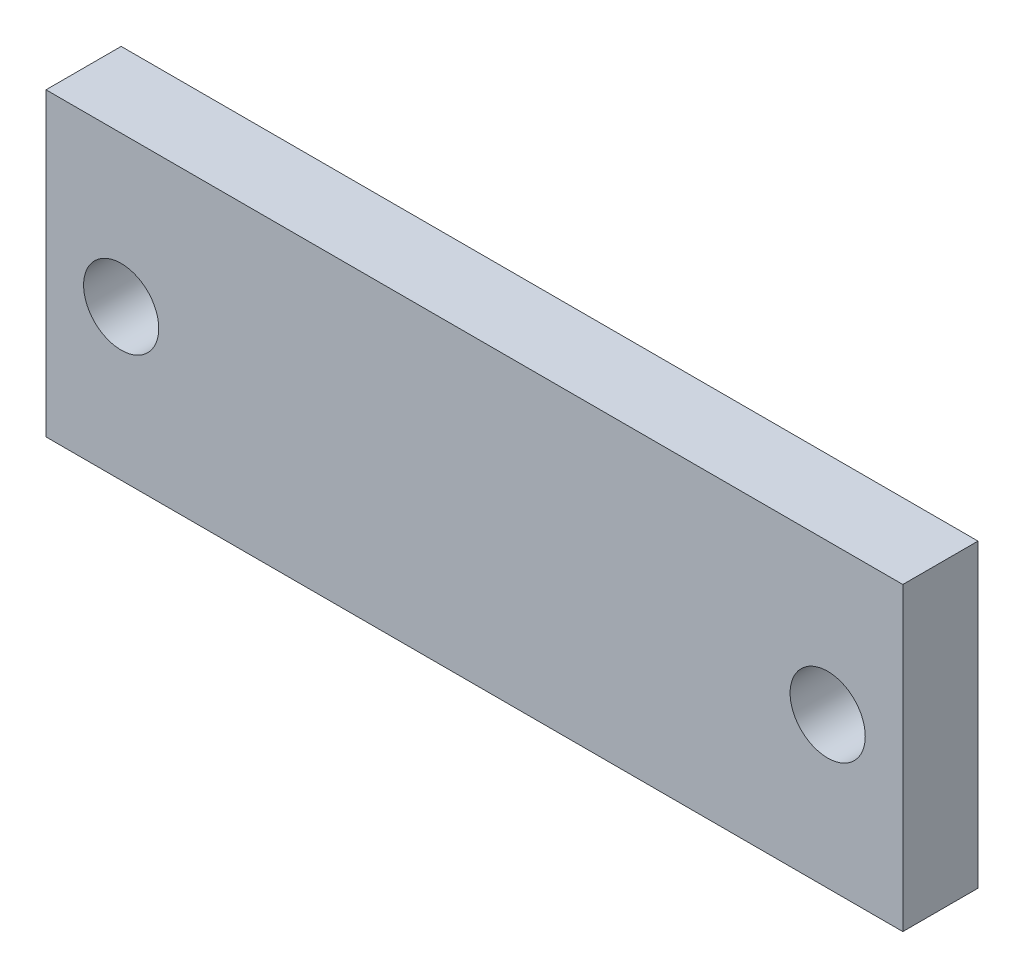
ISO-10303-21;
HEADER;
FILE_DESCRIPTION(('STEP AP214'),'2;1');
FILE_NAME('part.step','',(''),(''),'','','');
FILE_SCHEMA(('AUTOMOTIVE_DESIGN { 1 0 10303 214 1 1 1 1 }'));
ENDSEC;
DATA;
#1=APPLICATION_CONTEXT('core data for automotive mechanical design processes');
#2=APPLICATION_PROTOCOL_DEFINITION('international standard','automotive_design',2000,#1);
#3=PRODUCT_CONTEXT('',#1,'mechanical');
#4=PRODUCT('Part','Part','',(#3));
#5=PRODUCT_RELATED_PRODUCT_CATEGORY('part','',(#4));
#6=PRODUCT_DEFINITION_FORMATION('','',#4);
#7=PRODUCT_DEFINITION_CONTEXT('part definition',#1,'design');
#8=PRODUCT_DEFINITION('design','',#6,#7);
#9=PRODUCT_DEFINITION_SHAPE('','',#8);
#10=(LENGTH_UNIT() NAMED_UNIT(*) SI_UNIT(.MILLI.,.METRE.));
#11=(NAMED_UNIT(*) PLANE_ANGLE_UNIT() SI_UNIT($,.RADIAN.));
#12=(NAMED_UNIT(*) SI_UNIT($,.STERADIAN.) SOLID_ANGLE_UNIT());
#13=UNCERTAINTY_MEASURE_WITH_UNIT(LENGTH_MEASURE(1.E-05),#10,'distance_accuracy_value','');
#14=(GEOMETRIC_REPRESENTATION_CONTEXT(3) GLOBAL_UNCERTAINTY_ASSIGNED_CONTEXT((#13)) GLOBAL_UNIT_ASSIGNED_CONTEXT((#10,
#11,#12)) REPRESENTATION_CONTEXT('',''));
#15=CARTESIAN_POINT('',(0.,0.,0.));
#16=DIRECTION('',(0.,0.,1.));
#17=DIRECTION('',(1.,0.,0.));
#18=AXIS2_PLACEMENT_3D('',#15,#16,#17);
#19=CARTESIAN_POINT('',(0.,0.,5.));
#20=DIRECTION('',(0.,1.,0.));
#21=DIRECTION('',(0.,0.,1.));
#22=AXIS2_PLACEMENT_3D('',#19,#20,#21);
#23=PLANE('',#22);
#24=DIRECTION('',(1.,0.,0.));
#25=VECTOR('',#24,1.);
#26=CARTESIAN_POINT('',(0.,0.,0.));
#27=LINE('',#26,#25);
#28=CARTESIAN_POINT('',(0.,0.,0.));
#29=VERTEX_POINT('',#28);
#30=CARTESIAN_POINT('',(57.,0.,0.));
#31=VERTEX_POINT('',#30);
#32=EDGE_CURVE('E107',#29,#31,#27,.T.);
#33=ORIENTED_EDGE('',*,*,#32,.T.);
#34=DIRECTION('',(0.,0.,-1.));
#35=VECTOR('',#34,1.);
#36=CARTESIAN_POINT('',(57.,0.,5.));
#37=LINE('',#36,#35);
#38=CARTESIAN_POINT('',(57.,0.,5.));
#39=VERTEX_POINT('',#38);
#40=EDGE_CURVE('E11',#39,#31,#37,.T.);
#41=ORIENTED_EDGE('',*,*,#40,.F.);
#42=DIRECTION('',(1.,0.,0.));
#43=VECTOR('',#42,1.);
#44=CARTESIAN_POINT('',(0.,0.,5.));
#45=LINE('',#44,#43);
#46=CARTESIAN_POINT('',(0.,0.,5.));
#47=VERTEX_POINT('',#46);
#48=EDGE_CURVE('E87',#47,#39,#45,.T.);
#49=ORIENTED_EDGE('',*,*,#48,.F.);
#50=DIRECTION('',(0.,0.,-1.));
#51=VECTOR('',#50,1.);
#52=CARTESIAN_POINT('',(0.,0.,5.));
#53=LINE('',#52,#51);
#54=EDGE_CURVE('E54',#47,#29,#53,.T.);
#55=ORIENTED_EDGE('',*,*,#54,.T.);
#56=EDGE_LOOP('',(#33,#41,#49,#55));
#57=FACE_BOUND('',#56,.T.);
#58=ADVANCED_FACE('F37',(#57),#23,.F.);
#59=CARTESIAN_POINT('',(57.,0.,5.));
#60=DIRECTION('',(-1.,0.,0.));
#61=DIRECTION('',(0.,0.,1.));
#62=AXIS2_PLACEMENT_3D('',#59,#60,#61);
#63=PLANE('',#62);
#64=DIRECTION('',(0.,1.,0.));
#65=VECTOR('',#64,1.);
#66=CARTESIAN_POINT('',(57.,0.,0.));
#67=LINE('',#66,#65);
#68=CARTESIAN_POINT('',(57.,20.,0.));
#69=VERTEX_POINT('',#68);
#70=EDGE_CURVE('E92',#31,#69,#67,.T.);
#71=ORIENTED_EDGE('',*,*,#70,.T.);
#72=DIRECTION('',(0.,0.,-1.));
#73=VECTOR('',#72,1.);
#74=CARTESIAN_POINT('',(57.,20.,5.));
#75=LINE('',#74,#73);
#76=CARTESIAN_POINT('',(57.,20.,5.));
#77=VERTEX_POINT('',#76);
#78=EDGE_CURVE('E46',#77,#69,#75,.T.);
#79=ORIENTED_EDGE('',*,*,#78,.F.);
#80=DIRECTION('',(0.,1.,0.));
#81=VECTOR('',#80,1.);
#82=CARTESIAN_POINT('',(57.,0.,5.));
#83=LINE('',#82,#81);
#84=EDGE_CURVE('E79',#39,#77,#83,.T.);
#85=ORIENTED_EDGE('',*,*,#84,.F.);
#86=ORIENTED_EDGE('',*,*,#40,.T.);
#87=EDGE_LOOP('',(#71,#79,#85,#86));
#88=FACE_BOUND('',#87,.T.);
#89=ADVANCED_FACE('F91',(#88),#63,.F.);
#90=CARTESIAN_POINT('',(0.,20.,5.));
#91=DIRECTION('',(0.,1.,0.));
#92=DIRECTION('',(0.,0.,1.));
#93=AXIS2_PLACEMENT_3D('',#90,#91,#92);
#94=PLANE('',#93);
#95=DIRECTION('',(1.,0.,0.));
#96=VECTOR('',#95,1.);
#97=CARTESIAN_POINT('',(0.,20.,0.));
#98=LINE('',#97,#96);
#99=CARTESIAN_POINT('',(0.,20.,0.));
#100=VERTEX_POINT('',#99);
#101=EDGE_CURVE('E110',#100,#69,#98,.T.);
#102=ORIENTED_EDGE('',*,*,#101,.F.);
#103=DIRECTION('',(0.,0.,-1.));
#104=VECTOR('',#103,1.);
#105=CARTESIAN_POINT('',(0.,20.,5.));
#106=LINE('',#105,#104);
#107=CARTESIAN_POINT('',(0.,20.,5.));
#108=VERTEX_POINT('',#107);
#109=EDGE_CURVE('E68',#108,#100,#106,.T.);
#110=ORIENTED_EDGE('',*,*,#109,.F.);
#111=DIRECTION('',(1.,0.,0.));
#112=VECTOR('',#111,1.);
#113=CARTESIAN_POINT('',(0.,20.,5.));
#114=LINE('',#113,#112);
#115=EDGE_CURVE('E86',#108,#77,#114,.T.);
#116=ORIENTED_EDGE('',*,*,#115,.T.);
#117=ORIENTED_EDGE('',*,*,#78,.T.);
#118=EDGE_LOOP('',(#102,#110,#116,#117));
#119=FACE_BOUND('',#118,.T.);
#120=ADVANCED_FACE('F95',(#119),#94,.T.);
#121=CARTESIAN_POINT('',(5.,10.,5.));
#122=DIRECTION('',(0.,0.,-1.));
#123=DIRECTION('',(-1.,0.,0.));
#124=AXIS2_PLACEMENT_3D('',#121,#122,#123);
#125=CYLINDRICAL_SURFACE('',#124,2.5);
#126=CARTESIAN_POINT('',(5.,10.,5.));
#127=DIRECTION('',(0.,0.,1.));
#128=DIRECTION('',(1.,0.,0.));
#129=AXIS2_PLACEMENT_3D('',#126,#127,#128);
#130=CIRCLE('',#129,2.5);
#131=CARTESIAN_POINT('',(7.5,10.,5.));
#132=VERTEX_POINT('',#131);
#133=EDGE_CURVE('E119',#132,#132,#130,.T.);
#134=ORIENTED_EDGE('',*,*,#133,.T.);
#135=EDGE_LOOP('',(#134));
#136=FACE_BOUND('',#135,.T.);
#137=CARTESIAN_POINT('',(5.,10.,0.));
#138=DIRECTION('',(0.,0.,1.));
#139=DIRECTION('',(1.,0.,0.));
#140=AXIS2_PLACEMENT_3D('',#137,#138,#139);
#141=CIRCLE('',#140,2.5);
#142=CARTESIAN_POINT('',(7.5,10.,0.));
#143=VERTEX_POINT('',#142);
#144=EDGE_CURVE('E104',#143,#143,#141,.T.);
#145=ORIENTED_EDGE('',*,*,#144,.F.);
#146=EDGE_LOOP('',(#145));
#147=FACE_BOUND('',#146,.T.);
#148=ADVANCED_FACE('F127',(#136,#147),#125,.F.);
#149=CARTESIAN_POINT('',(52.,10.,5.));
#150=DIRECTION('',(0.,0.,-1.));
#151=DIRECTION('',(-1.,0.,0.));
#152=AXIS2_PLACEMENT_3D('',#149,#150,#151);
#153=CYLINDRICAL_SURFACE('',#152,2.5);
#154=CARTESIAN_POINT('',(52.,10.,5.));
#155=DIRECTION('',(0.,0.,1.));
#156=DIRECTION('',(1.,0.,0.));
#157=AXIS2_PLACEMENT_3D('',#154,#155,#156);
#158=CIRCLE('',#157,2.5);
#159=CARTESIAN_POINT('',(54.5,10.,5.));
#160=VERTEX_POINT('',#159);
#161=EDGE_CURVE('E115',#160,#160,#158,.T.);
#162=ORIENTED_EDGE('',*,*,#161,.T.);
#163=EDGE_LOOP('',(#162));
#164=FACE_BOUND('',#163,.T.);
#165=CARTESIAN_POINT('',(52.,10.,0.));
#166=DIRECTION('',(0.,0.,1.));
#167=DIRECTION('',(1.,0.,0.));
#168=AXIS2_PLACEMENT_3D('',#165,#166,#167);
#169=CIRCLE('',#168,2.5);
#170=CARTESIAN_POINT('',(54.5,10.,0.));
#171=VERTEX_POINT('',#170);
#172=EDGE_CURVE('E101',#171,#171,#169,.T.);
#173=ORIENTED_EDGE('',*,*,#172,.F.);
#174=EDGE_LOOP('',(#173));
#175=FACE_BOUND('',#174,.T.);
#176=ADVANCED_FACE('F39',(#164,#175),#153,.F.);
#177=CARTESIAN_POINT('',(0.,0.,5.));
#178=DIRECTION('',(-1.,0.,0.));
#179=DIRECTION('',(0.,0.,1.));
#180=AXIS2_PLACEMENT_3D('',#177,#178,#179);
#181=PLANE('',#180);
#182=DIRECTION('',(0.,1.,0.));
#183=VECTOR('',#182,1.);
#184=CARTESIAN_POINT('',(0.,0.,0.));
#185=LINE('',#184,#183);
#186=EDGE_CURVE('E112',#29,#100,#185,.T.);
#187=ORIENTED_EDGE('',*,*,#186,.F.);
#188=ORIENTED_EDGE('',*,*,#54,.F.);
#189=DIRECTION('',(0.,1.,0.));
#190=VECTOR('',#189,1.);
#191=CARTESIAN_POINT('',(0.,0.,5.));
#192=LINE('',#191,#190);
#193=EDGE_CURVE('E96',#47,#108,#192,.T.);
#194=ORIENTED_EDGE('',*,*,#193,.T.);
#195=ORIENTED_EDGE('',*,*,#109,.T.);
#196=EDGE_LOOP('',(#187,#188,#194,#195));
#197=FACE_BOUND('',#196,.T.);
#198=ADVANCED_FACE('F132',(#197),#181,.T.);
#199=CARTESIAN_POINT('',(0.,0.,5.));
#200=DIRECTION('',(0.,0.,1.));
#201=DIRECTION('',(1.,0.,0.));
#202=AXIS2_PLACEMENT_3D('',#199,#200,#201);
#203=PLANE('',#202);
#204=ORIENTED_EDGE('',*,*,#161,.F.);
#205=EDGE_LOOP('',(#204));
#206=FACE_BOUND('',#205,.T.);
#207=ORIENTED_EDGE('',*,*,#133,.F.);
#208=EDGE_LOOP('',(#207));
#209=FACE_BOUND('',#208,.T.);
#210=ORIENTED_EDGE('',*,*,#48,.T.);
#211=ORIENTED_EDGE('',*,*,#84,.T.);
#212=ORIENTED_EDGE('',*,*,#115,.F.);
#213=ORIENTED_EDGE('',*,*,#193,.F.);
#214=EDGE_LOOP('',(#210,#211,#212,#213));
#215=FACE_BOUND('',#214,.T.);
#216=ADVANCED_FACE('F83',(#206,#209,#215),#203,.T.);
#217=CARTESIAN_POINT('',(0.,0.,0.));
#218=DIRECTION('',(0.,0.,1.));
#219=DIRECTION('',(1.,0.,0.));
#220=AXIS2_PLACEMENT_3D('',#217,#218,#219);
#221=PLANE('',#220);
#222=ORIENTED_EDGE('',*,*,#172,.T.);
#223=EDGE_LOOP('',(#222));
#224=FACE_BOUND('',#223,.T.);
#225=ORIENTED_EDGE('',*,*,#144,.T.);
#226=EDGE_LOOP('',(#225));
#227=FACE_BOUND('',#226,.T.);
#228=ORIENTED_EDGE('',*,*,#32,.F.);
#229=ORIENTED_EDGE('',*,*,#186,.T.);
#230=ORIENTED_EDGE('',*,*,#101,.T.);
#231=ORIENTED_EDGE('',*,*,#70,.F.);
#232=EDGE_LOOP('',(#228,#229,#230,#231));
#233=FACE_BOUND('',#232,.T.);
#234=ADVANCED_FACE('F131',(#224,#227,#233),#221,.F.);
#235=CLOSED_SHELL('',(#58,#89,#120,#148,#176,#198,#216,#234));
#236=MANIFOLD_SOLID_BREP('B2',#235);
#237=ADVANCED_BREP_SHAPE_REPRESENTATION('',(#18,#236),#14);
#238=SHAPE_DEFINITION_REPRESENTATION(#9,#237);
ENDSEC;
END-ISO-10303-21;
